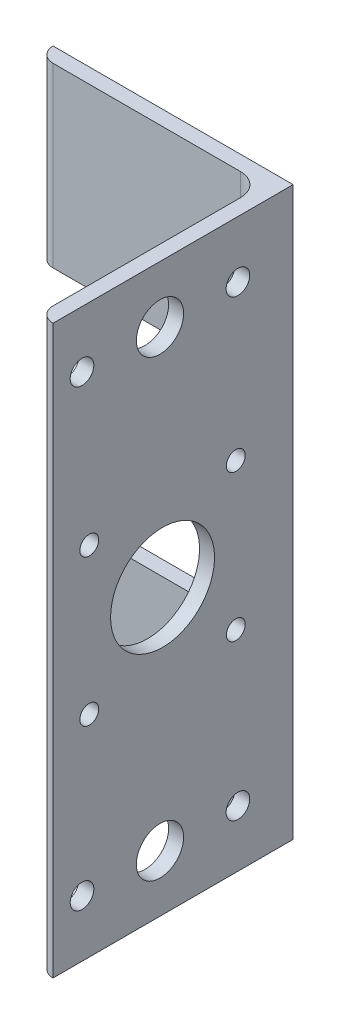
ISO-10303-21;
HEADER;
FILE_DESCRIPTION(('STEP AP214'),'2;1');
FILE_NAME('part.step','',(''),(''),'','','');
FILE_SCHEMA(('AUTOMOTIVE_DESIGN { 1 0 10303 214 1 1 1 1 }'));
ENDSEC;
DATA;
#1=APPLICATION_CONTEXT('core data for automotive mechanical design processes');
#2=APPLICATION_PROTOCOL_DEFINITION('international standard','automotive_design',2000,#1);
#3=PRODUCT_CONTEXT('',#1,'mechanical');
#4=PRODUCT('Part','Part','',(#3));
#5=PRODUCT_RELATED_PRODUCT_CATEGORY('part','',(#4));
#6=PRODUCT_DEFINITION_FORMATION('','',#4);
#7=PRODUCT_DEFINITION_CONTEXT('part definition',#1,'design');
#8=PRODUCT_DEFINITION('design','',#6,#7);
#9=PRODUCT_DEFINITION_SHAPE('','',#8);
#10=(LENGTH_UNIT() NAMED_UNIT(*) SI_UNIT(.MILLI.,.METRE.));
#11=(NAMED_UNIT(*) PLANE_ANGLE_UNIT() SI_UNIT($,.RADIAN.));
#12=(NAMED_UNIT(*) SI_UNIT($,.STERADIAN.) SOLID_ANGLE_UNIT());
#13=UNCERTAINTY_MEASURE_WITH_UNIT(LENGTH_MEASURE(1.E-05),#10,'distance_accuracy_value','');
#14=(GEOMETRIC_REPRESENTATION_CONTEXT(3) GLOBAL_UNCERTAINTY_ASSIGNED_CONTEXT((#13)) GLOBAL_UNIT_ASSIGNED_CONTEXT((#10,
#11,#12)) REPRESENTATION_CONTEXT('',''));
#15=CARTESIAN_POINT('',(0.,0.,0.));
#16=DIRECTION('',(0.,0.,1.));
#17=DIRECTION('',(1.,0.,0.));
#18=AXIS2_PLACEMENT_3D('',#15,#16,#17);
#19=CARTESIAN_POINT('',(-3.17500000000001,120.,47.63008));
#20=DIRECTION('',(1.,0.,0.));
#21=DIRECTION('',(0.,0.,-1.));
#22=AXIS2_PLACEMENT_3D('',#19,#20,#21);
#23=PLANE('',#22);
#24=CARTESIAN_POINT('',(-3.17499999999998,60.,27.63008));
#25=DIRECTION('',(-1.,0.,0.));
#26=DIRECTION('',(0.,0.,1.));
#27=AXIS2_PLACEMENT_3D('',#24,#25,#26);
#28=CIRCLE('',#27,11.);
#29=CARTESIAN_POINT('',(-3.17499999999998,60.,38.63008));
#30=VERTEX_POINT('',#29);
#31=EDGE_CURVE('E553',#30,#30,#28,.T.);
#32=ORIENTED_EDGE('',*,*,#31,.F.);
#33=EDGE_LOOP('',(#32));
#34=FACE_BOUND('',#33,.T.);
#35=CARTESIAN_POINT('',(-3.17500000000004,75.5,12.13008));
#36=DIRECTION('',(-1.,0.,0.));
#37=DIRECTION('',(0.,0.,1.));
#38=AXIS2_PLACEMENT_3D('',#35,#36,#37);
#39=CIRCLE('',#38,2.);
#40=CARTESIAN_POINT('',(-3.17500000000004,75.5,14.13008));
#41=VERTEX_POINT('',#40);
#42=EDGE_CURVE('E555',#41,#41,#39,.T.);
#43=ORIENTED_EDGE('',*,*,#42,.F.);
#44=EDGE_LOOP('',(#43));
#45=FACE_BOUND('',#44,.T.);
#46=CARTESIAN_POINT('',(-3.17500000000001,44.5,12.13008));
#47=DIRECTION('',(-1.,0.,0.));
#48=DIRECTION('',(0.,0.,1.));
#49=AXIS2_PLACEMENT_3D('',#46,#47,#48);
#50=CIRCLE('',#49,2.);
#51=CARTESIAN_POINT('',(-3.17500000000001,44.5,14.13008));
#52=VERTEX_POINT('',#51);
#53=EDGE_CURVE('E619',#52,#52,#50,.T.);
#54=ORIENTED_EDGE('',*,*,#53,.F.);
#55=EDGE_LOOP('',(#54));
#56=FACE_BOUND('',#55,.T.);
#57=CARTESIAN_POINT('',(-3.17499999999998,44.5,43.13008));
#58=DIRECTION('',(-1.,0.,0.));
#59=DIRECTION('',(0.,0.,1.));
#60=AXIS2_PLACEMENT_3D('',#57,#58,#59);
#61=CIRCLE('',#60,2.);
#62=CARTESIAN_POINT('',(-3.17499999999998,44.5,45.13008));
#63=VERTEX_POINT('',#62);
#64=EDGE_CURVE('E612',#63,#63,#61,.T.);
#65=ORIENTED_EDGE('',*,*,#64,.F.);
#66=EDGE_LOOP('',(#65));
#67=FACE_BOUND('',#66,.T.);
#68=CARTESIAN_POINT('',(-3.17500000000001,75.5,43.13008));
#69=DIRECTION('',(-1.,0.,0.));
#70=DIRECTION('',(0.,0.,1.));
#71=AXIS2_PLACEMENT_3D('',#68,#69,#70);
#72=CIRCLE('',#71,2.);
#73=CARTESIAN_POINT('',(-3.17500000000001,75.5,45.13008));
#74=VERTEX_POINT('',#73);
#75=EDGE_CURVE('E561',#74,#74,#72,.T.);
#76=ORIENTED_EDGE('',*,*,#75,.F.);
#77=EDGE_LOOP('',(#76));
#78=FACE_BOUND('',#77,.T.);
#79=CARTESIAN_POINT('',(-3.17500000000001,12.,11.675));
#80=DIRECTION('',(-1.,0.,0.));
#81=DIRECTION('',(0.,0.,1.));
#82=AXIS2_PLACEMENT_3D('',#79,#80,#81);
#83=CIRCLE('',#82,2.5);
#84=CARTESIAN_POINT('',(-3.17500000000001,12.,14.175));
#85=VERTEX_POINT('',#84);
#86=EDGE_CURVE('E572',#85,#85,#83,.T.);
#87=ORIENTED_EDGE('',*,*,#86,.F.);
#88=EDGE_LOOP('',(#87));
#89=FACE_BOUND('',#88,.T.);
#90=CARTESIAN_POINT('',(-3.17499999999998,12.,44.675));
#91=DIRECTION('',(-1.,0.,0.));
#92=DIRECTION('',(0.,0.,1.));
#93=AXIS2_PLACEMENT_3D('',#90,#91,#92);
#94=CIRCLE('',#93,2.5);
#95=CARTESIAN_POINT('',(-3.17499999999998,12.,47.175));
#96=VERTEX_POINT('',#95);
#97=EDGE_CURVE('E575',#96,#96,#94,.T.);
#98=ORIENTED_EDGE('',*,*,#97,.F.);
#99=EDGE_LOOP('',(#98));
#100=FACE_BOUND('',#99,.T.);
#101=CARTESIAN_POINT('',(-3.17499999999998,12.,28.175));
#102=DIRECTION('',(-1.,0.,0.));
#103=DIRECTION('',(0.,0.,1.));
#104=AXIS2_PLACEMENT_3D('',#101,#102,#103);
#105=CIRCLE('',#104,5.);
#106=CARTESIAN_POINT('',(-3.17499999999998,12.,33.175));
#107=VERTEX_POINT('',#106);
#108=EDGE_CURVE('E247',#107,#107,#105,.T.);
#109=ORIENTED_EDGE('',*,*,#108,.F.);
#110=EDGE_LOOP('',(#109));
#111=FACE_BOUND('',#110,.T.);
#112=DIRECTION('',(0.,-1.,0.));
#113=VECTOR('',#112,1.);
#114=CARTESIAN_POINT('',(-3.17500000000001,120.,7.93749999999999));
#115=LINE('',#114,#113);
#116=CARTESIAN_POINT('',(-3.17500000000001,120.,7.93749999999999));
#117=VERTEX_POINT('',#116);
#118=CARTESIAN_POINT('',(-3.17500000000001,82.5,7.93749999999999));
#119=VERTEX_POINT('',#118);
#120=EDGE_CURVE('E228',#117,#119,#115,.T.);
#121=ORIENTED_EDGE('',*,*,#120,.T.);
#122=DIRECTION('',(0.,0.,-1.));
#123=VECTOR('',#122,1.);
#124=CARTESIAN_POINT('',(-3.17500000000001,82.5,10.));
#125=LINE('',#124,#123);
#126=CARTESIAN_POINT('',(-3.17500000000001,82.5,0.));
#127=VERTEX_POINT('',#126);
#128=EDGE_CURVE('E102',#119,#127,#125,.T.);
#129=ORIENTED_EDGE('',*,*,#128,.T.);
#130=DIRECTION('',(0.,-1.,0.));
#131=VECTOR('',#130,1.);
#132=CARTESIAN_POINT('',(-3.17500000000001,82.5,0.));
#133=LINE('',#132,#131);
#134=CARTESIAN_POINT('',(-3.17500000000001,37.5,0.));
#135=VERTEX_POINT('',#134);
#136=EDGE_CURVE('E263',#127,#135,#133,.T.);
#137=ORIENTED_EDGE('',*,*,#136,.T.);
#138=DIRECTION('',(0.,0.,-1.));
#139=VECTOR('',#138,1.);
#140=CARTESIAN_POINT('',(-3.17500000000001,37.5,10.));
#141=LINE('',#140,#139);
#142=CARTESIAN_POINT('',(-3.17500000000001,37.5,7.93749999999999));
#143=VERTEX_POINT('',#142);
#144=EDGE_CURVE('E282',#143,#135,#141,.T.);
#145=ORIENTED_EDGE('',*,*,#144,.F.);
#146=CARTESIAN_POINT('',(-3.17500000000001,0.,7.93749999999999));
#147=VERTEX_POINT('',#146);
#148=EDGE_CURVE('E227',#143,#147,#115,.T.);
#149=ORIENTED_EDGE('',*,*,#148,.T.);
#150=DIRECTION('',(0.,0.,1.));
#151=VECTOR('',#150,1.);
#152=CARTESIAN_POINT('',(-3.17500000000001,0.,47.63008));
#153=LINE('',#152,#151);
#154=CARTESIAN_POINT('',(-3.17499999999998,0.,47.63008));
#155=VERTEX_POINT('',#154);
#156=EDGE_CURVE('E217',#147,#155,#153,.T.);
#157=ORIENTED_EDGE('',*,*,#156,.T.);
#158=DIRECTION('',(0.,-1.,0.));
#159=VECTOR('',#158,1.);
#160=CARTESIAN_POINT('',(-3.17500000000001,120.,47.63008));
#161=LINE('',#160,#159);
#162=CARTESIAN_POINT('',(-3.17500000000001,120.,47.63008));
#163=VERTEX_POINT('',#162);
#164=EDGE_CURVE('E192',#163,#155,#161,.T.);
#165=ORIENTED_EDGE('',*,*,#164,.F.);
#166=DIRECTION('',(0.,0.,1.));
#167=VECTOR('',#166,1.);
#168=CARTESIAN_POINT('',(-3.17500000000001,120.,47.63008));
#169=LINE('',#168,#167);
#170=EDGE_CURVE('E180',#117,#163,#169,.T.);
#171=ORIENTED_EDGE('',*,*,#170,.F.);
#172=EDGE_LOOP('',(#121,#129,#137,#145,#149,#157,#165,#171));
#173=FACE_BOUND('',#172,.T.);
#174=CARTESIAN_POINT('',(-3.17500000000001,108.,11.675));
#175=DIRECTION('',(-1.,0.,0.));
#176=DIRECTION('',(0.,0.,1.));
#177=AXIS2_PLACEMENT_3D('',#174,#175,#176);
#178=CIRCLE('',#177,2.5);
#179=CARTESIAN_POINT('',(-3.17500000000001,108.,14.175));
#180=VERTEX_POINT('',#179);
#181=EDGE_CURVE('E568',#180,#180,#178,.F.);
#182=ORIENTED_EDGE('',*,*,#181,.T.);
#183=EDGE_LOOP('',(#182));
#184=FACE_BOUND('',#183,.T.);
#185=CARTESIAN_POINT('',(-3.17499999999998,108.,28.175));
#186=DIRECTION('',(-1.,0.,0.));
#187=DIRECTION('',(0.,0.,1.));
#188=AXIS2_PLACEMENT_3D('',#185,#186,#187);
#189=CIRCLE('',#188,5.);
#190=CARTESIAN_POINT('',(-3.17499999999998,108.,33.175));
#191=VERTEX_POINT('',#190);
#192=EDGE_CURVE('E571',#191,#191,#189,.F.);
#193=ORIENTED_EDGE('',*,*,#192,.T.);
#194=EDGE_LOOP('',(#193));
#195=FACE_BOUND('',#194,.T.);
#196=CARTESIAN_POINT('',(-3.17499999999998,108.,44.675));
#197=DIRECTION('',(-1.,0.,0.));
#198=DIRECTION('',(0.,0.,1.));
#199=AXIS2_PLACEMENT_3D('',#196,#197,#198);
#200=CIRCLE('',#199,2.5);
#201=CARTESIAN_POINT('',(-3.17499999999998,108.,47.175));
#202=VERTEX_POINT('',#201);
#203=EDGE_CURVE('E578',#202,#202,#200,.F.);
#204=ORIENTED_EDGE('',*,*,#203,.T.);
#205=EDGE_LOOP('',(#204));
#206=FACE_BOUND('',#205,.T.);
#207=ADVANCED_FACE('F85',(#34,#45,#56,#67,#78,#89,#100,#111,#173,#184,#195,#206),#23,.F.);
#208=CARTESIAN_POINT('',(0.,120.,0.));
#209=DIRECTION('',(-1.,0.,0.));
#210=DIRECTION('',(0.,0.,1.));
#211=AXIS2_PLACEMENT_3D('',#208,#209,#210);
#212=PLANE('',#211);
#213=CARTESIAN_POINT('',(0.,60.,27.63008));
#214=DIRECTION('',(-1.,0.,0.));
#215=DIRECTION('',(0.,0.,1.));
#216=AXIS2_PLACEMENT_3D('',#213,#214,#215);
#217=CIRCLE('',#216,11.);
#218=CARTESIAN_POINT('',(0.,60.,38.63008));
#219=VERTEX_POINT('',#218);
#220=EDGE_CURVE('E551',#219,#219,#217,.F.);
#221=ORIENTED_EDGE('',*,*,#220,.F.);
#222=EDGE_LOOP('',(#221));
#223=FACE_BOUND('',#222,.T.);
#224=CARTESIAN_POINT('',(0.,75.5,12.13008));
#225=DIRECTION('',(-1.,0.,0.));
#226=DIRECTION('',(0.,0.,1.));
#227=AXIS2_PLACEMENT_3D('',#224,#225,#226);
#228=CIRCLE('',#227,2.);
#229=CARTESIAN_POINT('',(0.,75.5,14.13008));
#230=VERTEX_POINT('',#229);
#231=EDGE_CURVE('E558',#230,#230,#228,.F.);
#232=ORIENTED_EDGE('',*,*,#231,.F.);
#233=EDGE_LOOP('',(#232));
#234=FACE_BOUND('',#233,.T.);
#235=CARTESIAN_POINT('',(0.,44.5,12.13008));
#236=DIRECTION('',(-1.,0.,0.));
#237=DIRECTION('',(0.,0.,1.));
#238=AXIS2_PLACEMENT_3D('',#235,#236,#237);
#239=CIRCLE('',#238,2.);
#240=CARTESIAN_POINT('',(0.,44.5,14.13008));
#241=VERTEX_POINT('',#240);
#242=EDGE_CURVE('E616',#241,#241,#239,.F.);
#243=ORIENTED_EDGE('',*,*,#242,.F.);
#244=EDGE_LOOP('',(#243));
#245=FACE_BOUND('',#244,.T.);
#246=CARTESIAN_POINT('',(0.,44.5,43.13008));
#247=DIRECTION('',(-1.,0.,0.));
#248=DIRECTION('',(0.,0.,1.));
#249=AXIS2_PLACEMENT_3D('',#246,#247,#248);
#250=CIRCLE('',#249,2.);
#251=CARTESIAN_POINT('',(0.,44.5,45.13008));
#252=VERTEX_POINT('',#251);
#253=EDGE_CURVE('E565',#252,#252,#250,.F.);
#254=ORIENTED_EDGE('',*,*,#253,.F.);
#255=EDGE_LOOP('',(#254));
#256=FACE_BOUND('',#255,.T.);
#257=CARTESIAN_POINT('',(0.,75.5,43.13008));
#258=DIRECTION('',(-1.,0.,0.));
#259=DIRECTION('',(0.,0.,1.));
#260=AXIS2_PLACEMENT_3D('',#257,#258,#259);
#261=CIRCLE('',#260,2.);
#262=CARTESIAN_POINT('',(0.,75.5,45.13008));
#263=VERTEX_POINT('',#262);
#264=EDGE_CURVE('E564',#263,#263,#261,.F.);
#265=ORIENTED_EDGE('',*,*,#264,.F.);
#266=EDGE_LOOP('',(#265));
#267=FACE_BOUND('',#266,.T.);
#268=CARTESIAN_POINT('',(0.,12.,11.675));
#269=DIRECTION('',(-1.,0.,0.));
#270=DIRECTION('',(0.,0.,1.));
#271=AXIS2_PLACEMENT_3D('',#268,#269,#270);
#272=CIRCLE('',#271,2.5);
#273=CARTESIAN_POINT('',(0.,12.,14.175));
#274=VERTEX_POINT('',#273);
#275=EDGE_CURVE('E89',#274,#274,#272,.T.);
#276=ORIENTED_EDGE('',*,*,#275,.T.);
#277=EDGE_LOOP('',(#276));
#278=FACE_BOUND('',#277,.T.);
#279=CARTESIAN_POINT('',(0.,12.,44.675));
#280=DIRECTION('',(-1.,0.,0.));
#281=DIRECTION('',(0.,0.,1.));
#282=AXIS2_PLACEMENT_3D('',#279,#280,#281);
#283=CIRCLE('',#282,2.5);
#284=CARTESIAN_POINT('',(0.,12.,47.175));
#285=VERTEX_POINT('',#284);
#286=EDGE_CURVE('E255',#285,#285,#283,.T.);
#287=ORIENTED_EDGE('',*,*,#286,.T.);
#288=EDGE_LOOP('',(#287));
#289=FACE_BOUND('',#288,.T.);
#290=CARTESIAN_POINT('',(0.,12.,28.175));
#291=DIRECTION('',(-1.,0.,0.));
#292=DIRECTION('',(0.,0.,1.));
#293=AXIS2_PLACEMENT_3D('',#290,#291,#292);
#294=CIRCLE('',#293,5.);
#295=CARTESIAN_POINT('',(0.,12.,33.175));
#296=VERTEX_POINT('',#295);
#297=EDGE_CURVE('E243',#296,#296,#294,.T.);
#298=ORIENTED_EDGE('',*,*,#297,.T.);
#299=EDGE_LOOP('',(#298));
#300=FACE_BOUND('',#299,.T.);
#301=DIRECTION('',(0.,0.,-1.));
#302=VECTOR('',#301,1.);
#303=CARTESIAN_POINT('',(0.,0.,0.));
#304=LINE('',#303,#302);
#305=CARTESIAN_POINT('',(0.,0.,50.8));
#306=VERTEX_POINT('',#305);
#307=CARTESIAN_POINT('',(0.,0.,0.));
#308=VERTEX_POINT('',#307);
#309=EDGE_CURVE('E147',#306,#308,#304,.T.);
#310=ORIENTED_EDGE('',*,*,#309,.T.);
#311=DIRECTION('',(0.,-1.,0.));
#312=VECTOR('',#311,1.);
#313=CARTESIAN_POINT('',(0.,120.,0.));
#314=LINE('',#313,#312);
#315=CARTESIAN_POINT('',(0.,120.,0.));
#316=VERTEX_POINT('',#315);
#317=EDGE_CURVE('E197',#316,#308,#314,.T.);
#318=ORIENTED_EDGE('',*,*,#317,.F.);
#319=DIRECTION('',(0.,0.,-1.));
#320=VECTOR('',#319,1.);
#321=CARTESIAN_POINT('',(0.,120.,0.));
#322=LINE('',#321,#320);
#323=CARTESIAN_POINT('',(0.,120.,50.8));
#324=VERTEX_POINT('',#323);
#325=EDGE_CURVE('E111',#324,#316,#322,.T.);
#326=ORIENTED_EDGE('',*,*,#325,.F.);
#327=DIRECTION('',(0.,-1.,0.));
#328=VECTOR('',#327,1.);
#329=CARTESIAN_POINT('',(0.,120.,50.8));
#330=LINE('',#329,#328);
#331=EDGE_CURVE('E193',#324,#306,#330,.T.);
#332=ORIENTED_EDGE('',*,*,#331,.T.);
#333=EDGE_LOOP('',(#310,#318,#326,#332));
#334=FACE_BOUND('',#333,.T.);
#335=CARTESIAN_POINT('',(0.,108.,11.675));
#336=DIRECTION('',(-1.,0.,0.));
#337=DIRECTION('',(0.,0.,1.));
#338=AXIS2_PLACEMENT_3D('',#335,#336,#337);
#339=CIRCLE('',#338,2.5);
#340=CARTESIAN_POINT('',(0.,108.,14.175));
#341=VERTEX_POINT('',#340);
#342=EDGE_CURVE('E246',#341,#341,#339,.F.);
#343=ORIENTED_EDGE('',*,*,#342,.F.);
#344=EDGE_LOOP('',(#343));
#345=FACE_BOUND('',#344,.T.);
#346=CARTESIAN_POINT('',(0.,108.,28.175));
#347=DIRECTION('',(-1.,0.,0.));
#348=DIRECTION('',(0.,0.,1.));
#349=AXIS2_PLACEMENT_3D('',#346,#347,#348);
#350=CIRCLE('',#349,5.);
#351=CARTESIAN_POINT('',(0.,108.,33.175));
#352=VERTEX_POINT('',#351);
#353=EDGE_CURVE('E250',#352,#352,#350,.F.);
#354=ORIENTED_EDGE('',*,*,#353,.F.);
#355=EDGE_LOOP('',(#354));
#356=FACE_BOUND('',#355,.T.);
#357=CARTESIAN_POINT('',(0.,108.,44.675));
#358=DIRECTION('',(-1.,0.,0.));
#359=DIRECTION('',(0.,0.,1.));
#360=AXIS2_PLACEMENT_3D('',#357,#358,#359);
#361=CIRCLE('',#360,2.5);
#362=CARTESIAN_POINT('',(0.,108.,47.175));
#363=VERTEX_POINT('',#362);
#364=EDGE_CURVE('E253',#363,#363,#361,.F.);
#365=ORIENTED_EDGE('',*,*,#364,.F.);
#366=EDGE_LOOP('',(#365));
#367=FACE_BOUND('',#366,.T.);
#368=ADVANCED_FACE('F322',(#223,#234,#245,#256,#267,#278,#289,#300,#334,#345,#356,#367),#212,.F.);
#369=CARTESIAN_POINT('',(-50.8,120.,0.00507999999999065));
#370=DIRECTION('',(1.,0.,0.));
#371=DIRECTION('',(0.,0.,-1.));
#372=AXIS2_PLACEMENT_3D('',#369,#370,#371);
#373=PLANE('',#372);
#374=DIRECTION('',(0.,-1.,0.));
#375=VECTOR('',#374,1.);
#376=CARTESIAN_POINT('',(-50.8,120.,0.00507999999999065));
#377=LINE('',#376,#375);
#378=CARTESIAN_POINT('',(-50.8,37.5,0.00507999999999065));
#379=VERTEX_POINT('',#378);
#380=CARTESIAN_POINT('',(-50.8,0.,0.00507999999999065));
#381=VERTEX_POINT('',#380);
#382=EDGE_CURVE('E239',#379,#381,#377,.T.);
#383=ORIENTED_EDGE('',*,*,#382,.F.);
#384=DIRECTION('',(0.,0.,-1.));
#385=VECTOR('',#384,1.);
#386=CARTESIAN_POINT('',(-50.8,37.5,10.));
#387=LINE('',#386,#385);
#388=CARTESIAN_POINT('',(-50.8,37.5,0.));
#389=VERTEX_POINT('',#388);
#390=EDGE_CURVE('E278',#379,#389,#387,.T.);
#391=ORIENTED_EDGE('',*,*,#390,.T.);
#392=DIRECTION('',(0.,-1.,0.));
#393=VECTOR('',#392,1.);
#394=CARTESIAN_POINT('',(-50.8,120.,0.));
#395=LINE('',#394,#393);
#396=CARTESIAN_POINT('',(-50.8,0.,0.));
#397=VERTEX_POINT('',#396);
#398=EDGE_CURVE('E94',#389,#397,#395,.T.);
#399=ORIENTED_EDGE('',*,*,#398,.T.);
#400=DIRECTION('',(0.,0.,1.));
#401=VECTOR('',#400,1.);
#402=CARTESIAN_POINT('',(-50.8,0.,0.00507999999999065));
#403=LINE('',#402,#401);
#404=EDGE_CURVE('E204',#397,#381,#403,.T.);
#405=ORIENTED_EDGE('',*,*,#404,.T.);
#406=EDGE_LOOP('',(#383,#391,#399,#405));
#407=FACE_BOUND('',#406,.T.);
#408=ADVANCED_FACE('F375',(#407),#373,.F.);
#409=CARTESIAN_POINT('',(-47.63008,120.,0.00507999999999065));
#410=DIRECTION('',(0.,-1.,0.));
#411=DIRECTION('',(0.,0.,-1.));
#412=AXIS2_PLACEMENT_3D('',#409,#410,#411);
#413=CYLINDRICAL_SURFACE('',#412,3.16992);
#414=DIRECTION('',(0.,-1.,0.));
#415=VECTOR('',#414,1.);
#416=CARTESIAN_POINT('',(-47.63008,120.,3.17500000000001));
#417=LINE('',#416,#415);
#418=CARTESIAN_POINT('',(-47.63008,37.5,3.17500000000001));
#419=VERTEX_POINT('',#418);
#420=CARTESIAN_POINT('',(-47.63008,0.,3.17500000000001));
#421=VERTEX_POINT('',#420);
#422=EDGE_CURVE('E235',#419,#421,#417,.T.);
#423=ORIENTED_EDGE('',*,*,#422,.F.);
#424=CARTESIAN_POINT('',(-47.63008,37.5,0.00507999999999065));
#425=DIRECTION('',(0.,-1.,0.));
#426=DIRECTION('',(0.,0.,-1.));
#427=AXIS2_PLACEMENT_3D('',#424,#425,#426);
#428=CIRCLE('',#427,3.16992);
#429=EDGE_CURVE('E205',#419,#379,#428,.T.);
#430=ORIENTED_EDGE('',*,*,#429,.T.);
#431=ORIENTED_EDGE('',*,*,#382,.T.);
#432=CARTESIAN_POINT('',(-47.63008,0.,0.00507999999999065));
#433=DIRECTION('',(0.,1.,0.));
#434=DIRECTION('',(0.,0.,1.));
#435=AXIS2_PLACEMENT_3D('',#432,#433,#434);
#436=CIRCLE('',#435,3.16992);
#437=EDGE_CURVE('E208',#381,#421,#436,.T.);
#438=ORIENTED_EDGE('',*,*,#437,.T.);
#439=EDGE_LOOP('',(#423,#430,#431,#438));
#440=FACE_BOUND('',#439,.T.);
#441=ADVANCED_FACE('F363',(#440),#413,.T.);
#442=CARTESIAN_POINT('',(-7.93750000000001,120.,3.17499999999998));
#443=DIRECTION('',(0.,0.,-1.));
#444=DIRECTION('',(-1.,0.,0.));
#445=AXIS2_PLACEMENT_3D('',#442,#443,#444);
#446=PLANE('',#445);
#447=DIRECTION('',(0.,-1.,0.));
#448=VECTOR('',#447,1.);
#449=CARTESIAN_POINT('',(-7.93750000000001,120.,3.17499999999998));
#450=LINE('',#449,#448);
#451=CARTESIAN_POINT('',(-7.93750000000001,37.5,3.17499999999998));
#452=VERTEX_POINT('',#451);
#453=CARTESIAN_POINT('',(-7.93750000000001,0.,3.17499999999998));
#454=VERTEX_POINT('',#453);
#455=EDGE_CURVE('E231',#452,#454,#450,.T.);
#456=ORIENTED_EDGE('',*,*,#455,.F.);
#457=DIRECTION('',(-1.,0.,0.));
#458=VECTOR('',#457,1.);
#459=CARTESIAN_POINT('',(-7.93750000000001,37.5,3.17499999999998));
#460=LINE('',#459,#458);
#461=EDGE_CURVE('E297',#452,#419,#460,.T.);
#462=ORIENTED_EDGE('',*,*,#461,.T.);
#463=ORIENTED_EDGE('',*,*,#422,.T.);
#464=DIRECTION('',(1.,0.,0.));
#465=VECTOR('',#464,1.);
#466=CARTESIAN_POINT('',(-7.93750000000001,0.,3.17499999999998));
#467=LINE('',#466,#465);
#468=EDGE_CURVE('E211',#421,#454,#467,.T.);
#469=ORIENTED_EDGE('',*,*,#468,.T.);
#470=EDGE_LOOP('',(#456,#462,#463,#469));
#471=FACE_BOUND('',#470,.T.);
#472=ADVANCED_FACE('F362',(#471),#446,.F.);
#473=CARTESIAN_POINT('',(-7.93750000000001,120.,7.93749999999999));
#474=DIRECTION('',(0.,-1.,0.));
#475=DIRECTION('',(0.,0.,-1.));
#476=AXIS2_PLACEMENT_3D('',#473,#474,#475);
#477=CYLINDRICAL_SURFACE('',#476,4.7625);
#478=ORIENTED_EDGE('',*,*,#148,.F.);
#479=CARTESIAN_POINT('',(-7.93750000000001,37.5,7.93749999999999));
#480=DIRECTION('',(0.,-1.,0.));
#481=DIRECTION('',(0.,0.,-1.));
#482=AXIS2_PLACEMENT_3D('',#479,#480,#481);
#483=CIRCLE('',#482,4.7625);
#484=EDGE_CURVE('E294',#143,#452,#483,.F.);
#485=ORIENTED_EDGE('',*,*,#484,.T.);
#486=ORIENTED_EDGE('',*,*,#455,.T.);
#487=CARTESIAN_POINT('',(-7.93750000000001,0.,7.93749999999999));
#488=DIRECTION('',(0.,-1.,0.));
#489=DIRECTION('',(0.,0.,-1.));
#490=AXIS2_PLACEMENT_3D('',#487,#488,#489);
#491=CIRCLE('',#490,4.7625);
#492=EDGE_CURVE('E214',#454,#147,#491,.T.);
#493=ORIENTED_EDGE('',*,*,#492,.T.);
#494=EDGE_LOOP('',(#478,#485,#486,#493));
#495=FACE_BOUND('',#494,.T.);
#496=ADVANCED_FACE('F369',(#495),#477,.F.);
#497=CARTESIAN_POINT('',(-50.8,120.,0.));
#498=DIRECTION('',(0.,0.,1.));
#499=DIRECTION('',(1.,0.,0.));
#500=AXIS2_PLACEMENT_3D('',#497,#498,#499);
#501=PLANE('',#500);
#502=ORIENTED_EDGE('',*,*,#398,.F.);
#503=DIRECTION('',(-1.,0.,0.));
#504=VECTOR('',#503,1.);
#505=CARTESIAN_POINT('',(-3.17500000000001,37.5,0.));
#506=LINE('',#505,#504);
#507=EDGE_CURVE('E270',#135,#389,#506,.T.);
#508=ORIENTED_EDGE('',*,*,#507,.F.);
#509=ORIENTED_EDGE('',*,*,#136,.F.);
#510=DIRECTION('',(1.,0.,0.));
#511=VECTOR('',#510,1.);
#512=CARTESIAN_POINT('',(-3.17500000000001,82.5,0.));
#513=LINE('',#512,#511);
#514=CARTESIAN_POINT('',(-50.8,82.5,0.));
#515=VERTEX_POINT('',#514);
#516=EDGE_CURVE('E260',#515,#127,#513,.T.);
#517=ORIENTED_EDGE('',*,*,#516,.F.);
#518=CARTESIAN_POINT('',(-50.8,120.,0.));
#519=VERTEX_POINT('',#518);
#520=EDGE_CURVE('E15',#519,#515,#395,.T.);
#521=ORIENTED_EDGE('',*,*,#520,.F.);
#522=DIRECTION('',(-1.,0.,0.));
#523=VECTOR('',#522,1.);
#524=CARTESIAN_POINT('',(-50.8,120.,0.));
#525=LINE('',#524,#523);
#526=EDGE_CURVE('E223',#316,#519,#525,.T.);
#527=ORIENTED_EDGE('',*,*,#526,.F.);
#528=ORIENTED_EDGE('',*,*,#317,.T.);
#529=DIRECTION('',(-1.,0.,0.));
#530=VECTOR('',#529,1.);
#531=CARTESIAN_POINT('',(-50.8,0.,0.));
#532=LINE('',#531,#530);
#533=EDGE_CURVE('E201',#308,#397,#532,.T.);
#534=ORIENTED_EDGE('',*,*,#533,.T.);
#535=EDGE_LOOP('',(#502,#508,#509,#517,#521,#527,#528,#534));
#536=FACE_BOUND('',#535,.T.);
#537=ADVANCED_FACE('F87',(#536),#501,.F.);
#538=ORIENTED_EDGE('',*,*,#520,.T.);
#539=DIRECTION('',(0.,0.,-1.));
#540=VECTOR('',#539,1.);
#541=CARTESIAN_POINT('',(-50.8,82.5,10.));
#542=LINE('',#541,#540);
#543=CARTESIAN_POINT('',(-50.8,82.5,0.00507999999999065));
#544=VERTEX_POINT('',#543);
#545=EDGE_CURVE('E277',#544,#515,#542,.T.);
#546=ORIENTED_EDGE('',*,*,#545,.F.);
#547=CARTESIAN_POINT('',(-50.8,120.,0.00507999999999065));
#548=VERTEX_POINT('',#547);
#549=EDGE_CURVE('E240',#548,#544,#377,.T.);
#550=ORIENTED_EDGE('',*,*,#549,.F.);
#551=DIRECTION('',(0.,0.,1.));
#552=VECTOR('',#551,1.);
#553=CARTESIAN_POINT('',(-50.8,120.,0.00507999999999065));
#554=LINE('',#553,#552);
#555=EDGE_CURVE('E155',#519,#548,#554,.T.);
#556=ORIENTED_EDGE('',*,*,#555,.F.);
#557=EDGE_LOOP('',(#538,#546,#550,#556));
#558=FACE_BOUND('',#557,.T.);
#559=ADVANCED_FACE('F331',(#558),#373,.F.);
#560=ORIENTED_EDGE('',*,*,#549,.T.);
#561=CARTESIAN_POINT('',(-47.63008,82.5,0.00507999999999065));
#562=DIRECTION('',(0.,1.,0.));
#563=DIRECTION('',(0.,0.,1.));
#564=AXIS2_PLACEMENT_3D('',#561,#562,#563);
#565=CIRCLE('',#564,3.16992);
#566=CARTESIAN_POINT('',(-47.63008,82.5,3.17500000000001));
#567=VERTEX_POINT('',#566);
#568=EDGE_CURVE('E291',#544,#567,#565,.T.);
#569=ORIENTED_EDGE('',*,*,#568,.T.);
#570=CARTESIAN_POINT('',(-47.63008,120.,3.17500000000001));
#571=VERTEX_POINT('',#570);
#572=EDGE_CURVE('E236',#571,#567,#417,.T.);
#573=ORIENTED_EDGE('',*,*,#572,.F.);
#574=CARTESIAN_POINT('',(-47.63008,120.,0.00507999999999065));
#575=DIRECTION('',(0.,1.,0.));
#576=DIRECTION('',(0.,0.,1.));
#577=AXIS2_PLACEMENT_3D('',#574,#575,#576);
#578=CIRCLE('',#577,3.16992);
#579=EDGE_CURVE('E304',#548,#571,#578,.T.);
#580=ORIENTED_EDGE('',*,*,#579,.F.);
#581=EDGE_LOOP('',(#560,#569,#573,#580));
#582=FACE_BOUND('',#581,.T.);
#583=ADVANCED_FACE('F334',(#582),#413,.T.);
#584=ORIENTED_EDGE('',*,*,#572,.T.);
#585=DIRECTION('',(1.,0.,0.));
#586=VECTOR('',#585,1.);
#587=CARTESIAN_POINT('',(-7.93750000000001,82.5,3.17499999999998));
#588=LINE('',#587,#586);
#589=CARTESIAN_POINT('',(-7.93750000000001,82.5,3.17499999999998));
#590=VERTEX_POINT('',#589);
#591=EDGE_CURVE('E288',#567,#590,#588,.T.);
#592=ORIENTED_EDGE('',*,*,#591,.T.);
#593=CARTESIAN_POINT('',(-7.93750000000001,120.,3.17499999999998));
#594=VERTEX_POINT('',#593);
#595=EDGE_CURVE('E232',#594,#590,#450,.T.);
#596=ORIENTED_EDGE('',*,*,#595,.F.);
#597=DIRECTION('',(1.,0.,0.));
#598=VECTOR('',#597,1.);
#599=CARTESIAN_POINT('',(-7.93750000000001,120.,3.17499999999998));
#600=LINE('',#599,#598);
#601=EDGE_CURVE('E306',#571,#594,#600,.T.);
#602=ORIENTED_EDGE('',*,*,#601,.F.);
#603=EDGE_LOOP('',(#584,#592,#596,#602));
#604=FACE_BOUND('',#603,.T.);
#605=ADVANCED_FACE('F338',(#604),#446,.F.);
#606=ORIENTED_EDGE('',*,*,#595,.T.);
#607=CARTESIAN_POINT('',(-7.93750000000001,82.5,7.93749999999999));
#608=DIRECTION('',(0.,1.,0.));
#609=DIRECTION('',(0.,0.,1.));
#610=AXIS2_PLACEMENT_3D('',#607,#608,#609);
#611=CIRCLE('',#610,4.7625);
#612=EDGE_CURVE('E281',#590,#119,#611,.F.);
#613=ORIENTED_EDGE('',*,*,#612,.T.);
#614=ORIENTED_EDGE('',*,*,#120,.F.);
#615=CARTESIAN_POINT('',(-7.93750000000001,120.,7.93749999999999));
#616=DIRECTION('',(0.,-1.,0.));
#617=DIRECTION('',(0.,0.,-1.));
#618=AXIS2_PLACEMENT_3D('',#615,#616,#617);
#619=CIRCLE('',#618,4.7625);
#620=EDGE_CURVE('E308',#594,#117,#619,.T.);
#621=ORIENTED_EDGE('',*,*,#620,.F.);
#622=EDGE_LOOP('',(#606,#613,#614,#621));
#623=FACE_BOUND('',#622,.T.);
#624=ADVANCED_FACE('F314',(#623),#477,.F.);
#625=CARTESIAN_POINT('',(-0.00507999999999065,120.,47.63008));
#626=DIRECTION('',(0.,-1.,0.));
#627=DIRECTION('',(0.,0.,-1.));
#628=AXIS2_PLACEMENT_3D('',#625,#626,#627);
#629=CYLINDRICAL_SURFACE('',#628,3.16992);
#630=CARTESIAN_POINT('',(-0.00507999999999065,0.,47.63008));
#631=DIRECTION('',(0.,1.,0.));
#632=DIRECTION('',(0.,0.,-1.));
#633=AXIS2_PLACEMENT_3D('',#630,#631,#632);
#634=CIRCLE('',#633,3.16992);
#635=CARTESIAN_POINT('',(-0.00507999999999065,0.,50.8));
#636=VERTEX_POINT('',#635);
#637=EDGE_CURVE('E189',#155,#636,#634,.T.);
#638=ORIENTED_EDGE('',*,*,#637,.T.);
#639=DIRECTION('',(0.,-1.,0.));
#640=VECTOR('',#639,1.);
#641=CARTESIAN_POINT('',(-0.00507999999999065,120.,50.8));
#642=LINE('',#641,#640);
#643=CARTESIAN_POINT('',(-0.00507999999999065,120.,50.8));
#644=VERTEX_POINT('',#643);
#645=EDGE_CURVE('E186',#644,#636,#642,.T.);
#646=ORIENTED_EDGE('',*,*,#645,.F.);
#647=CARTESIAN_POINT('',(-0.00507999999999065,120.,47.63008));
#648=DIRECTION('',(0.,1.,0.));
#649=DIRECTION('',(0.,0.,-1.));
#650=AXIS2_PLACEMENT_3D('',#647,#648,#649);
#651=CIRCLE('',#650,3.16992);
#652=EDGE_CURVE('E173',#163,#644,#651,.T.);
#653=ORIENTED_EDGE('',*,*,#652,.F.);
#654=ORIENTED_EDGE('',*,*,#164,.T.);
#655=EDGE_LOOP('',(#638,#646,#653,#654));
#656=FACE_BOUND('',#655,.T.);
#657=ADVANCED_FACE('F187',(#656),#629,.T.);
#658=CARTESIAN_POINT('',(0.,120.,50.8));
#659=DIRECTION('',(0.,0.,-1.));
#660=DIRECTION('',(-1.,0.,0.));
#661=AXIS2_PLACEMENT_3D('',#658,#659,#660);
#662=PLANE('',#661);
#663=DIRECTION('',(1.,0.,0.));
#664=VECTOR('',#663,1.);
#665=CARTESIAN_POINT('',(0.,0.,50.8));
#666=LINE('',#665,#664);
#667=EDGE_CURVE('E220',#636,#306,#666,.T.);
#668=ORIENTED_EDGE('',*,*,#667,.T.);
#669=ORIENTED_EDGE('',*,*,#331,.F.);
#670=DIRECTION('',(1.,0.,0.));
#671=VECTOR('',#670,1.);
#672=CARTESIAN_POINT('',(0.,120.,50.8));
#673=LINE('',#672,#671);
#674=EDGE_CURVE('E177',#644,#324,#673,.T.);
#675=ORIENTED_EDGE('',*,*,#674,.F.);
#676=ORIENTED_EDGE('',*,*,#645,.T.);
#677=EDGE_LOOP('',(#668,#669,#675,#676));
#678=FACE_BOUND('',#677,.T.);
#679=ADVANCED_FACE('F195',(#678),#662,.F.);
#680=CARTESIAN_POINT('',(-0.00507999999999065,120.,47.63008));
#681=DIRECTION('',(0.,-1.,0.));
#682=DIRECTION('',(0.,0.,-1.));
#683=AXIS2_PLACEMENT_3D('',#680,#681,#682);
#684=PLANE('',#683);
#685=ORIENTED_EDGE('',*,*,#526,.T.);
#686=ORIENTED_EDGE('',*,*,#555,.T.);
#687=ORIENTED_EDGE('',*,*,#579,.T.);
#688=ORIENTED_EDGE('',*,*,#601,.T.);
#689=ORIENTED_EDGE('',*,*,#620,.T.);
#690=ORIENTED_EDGE('',*,*,#170,.T.);
#691=ORIENTED_EDGE('',*,*,#652,.T.);
#692=ORIENTED_EDGE('',*,*,#674,.T.);
#693=ORIENTED_EDGE('',*,*,#325,.T.);
#694=EDGE_LOOP('',(#685,#686,#687,#688,#689,#690,#691,#692,#693));
#695=FACE_BOUND('',#694,.T.);
#696=ADVANCED_FACE('F175',(#695),#684,.F.);
#697=CARTESIAN_POINT('',(-0.00507999999999065,0.,47.63008));
#698=DIRECTION('',(0.,-1.,0.));
#699=DIRECTION('',(0.,0.,-1.));
#700=AXIS2_PLACEMENT_3D('',#697,#698,#699);
#701=PLANE('',#700);
#702=ORIENTED_EDGE('',*,*,#533,.F.);
#703=ORIENTED_EDGE('',*,*,#309,.F.);
#704=ORIENTED_EDGE('',*,*,#667,.F.);
#705=ORIENTED_EDGE('',*,*,#637,.F.);
#706=ORIENTED_EDGE('',*,*,#156,.F.);
#707=ORIENTED_EDGE('',*,*,#492,.F.);
#708=ORIENTED_EDGE('',*,*,#468,.F.);
#709=ORIENTED_EDGE('',*,*,#437,.F.);
#710=ORIENTED_EDGE('',*,*,#404,.F.);
#711=EDGE_LOOP('',(#702,#703,#704,#705,#706,#707,#708,#709,#710));
#712=FACE_BOUND('',#711,.T.);
#713=ADVANCED_FACE('F320',(#712),#701,.T.);
#714=CARTESIAN_POINT('',(-3.17500000000001,37.5,10.));
#715=DIRECTION('',(0.,-1.,0.));
#716=DIRECTION('',(0.,0.,-1.));
#717=AXIS2_PLACEMENT_3D('',#714,#715,#716);
#718=PLANE('',#717);
#719=ORIENTED_EDGE('',*,*,#461,.F.);
#720=ORIENTED_EDGE('',*,*,#484,.F.);
#721=ORIENTED_EDGE('',*,*,#144,.T.);
#722=ORIENTED_EDGE('',*,*,#507,.T.);
#723=ORIENTED_EDGE('',*,*,#390,.F.);
#724=ORIENTED_EDGE('',*,*,#429,.F.);
#725=EDGE_LOOP('',(#719,#720,#721,#722,#723,#724));
#726=FACE_BOUND('',#725,.T.);
#727=ADVANCED_FACE('F356',(#726),#718,.F.);
#728=CARTESIAN_POINT('',(-3.17500000000001,82.5,10.));
#729=DIRECTION('',(0.,1.,0.));
#730=DIRECTION('',(0.,0.,1.));
#731=AXIS2_PLACEMENT_3D('',#728,#729,#730);
#732=PLANE('',#731);
#733=ORIENTED_EDGE('',*,*,#545,.T.);
#734=ORIENTED_EDGE('',*,*,#516,.T.);
#735=ORIENTED_EDGE('',*,*,#128,.F.);
#736=ORIENTED_EDGE('',*,*,#612,.F.);
#737=ORIENTED_EDGE('',*,*,#591,.F.);
#738=ORIENTED_EDGE('',*,*,#568,.F.);
#739=EDGE_LOOP('',(#733,#734,#735,#736,#737,#738));
#740=FACE_BOUND('',#739,.T.);
#741=ADVANCED_FACE('F448',(#740),#732,.F.);
#742=CARTESIAN_POINT('',(6.825,12.,28.175));
#743=DIRECTION('',(-1.,0.,0.));
#744=DIRECTION('',(0.,0.,1.));
#745=AXIS2_PLACEMENT_3D('',#742,#743,#744);
#746=CYLINDRICAL_SURFACE('',#745,5.);
#747=ORIENTED_EDGE('',*,*,#108,.T.);
#748=EDGE_LOOP('',(#747));
#749=FACE_BOUND('',#748,.T.);
#750=ORIENTED_EDGE('',*,*,#297,.F.);
#751=EDGE_LOOP('',(#750));
#752=FACE_BOUND('',#751,.T.);
#753=ADVANCED_FACE('F456',(#749,#752),#746,.F.);
#754=CARTESIAN_POINT('',(6.825,108.,11.675));
#755=DIRECTION('',(-1.,0.,0.));
#756=DIRECTION('',(0.,0.,1.));
#757=AXIS2_PLACEMENT_3D('',#754,#755,#756);
#758=CYLINDRICAL_SURFACE('',#757,2.5);
#759=ORIENTED_EDGE('',*,*,#181,.F.);
#760=EDGE_LOOP('',(#759));
#761=FACE_BOUND('',#760,.T.);
#762=ORIENTED_EDGE('',*,*,#342,.T.);
#763=EDGE_LOOP('',(#762));
#764=FACE_BOUND('',#763,.T.);
#765=ADVANCED_FACE('F464',(#761,#764),#758,.F.);
#766=CARTESIAN_POINT('',(6.825,108.,28.175));
#767=DIRECTION('',(-1.,0.,0.));
#768=DIRECTION('',(0.,0.,1.));
#769=AXIS2_PLACEMENT_3D('',#766,#767,#768);
#770=CYLINDRICAL_SURFACE('',#769,5.);
#771=ORIENTED_EDGE('',*,*,#192,.F.);
#772=EDGE_LOOP('',(#771));
#773=FACE_BOUND('',#772,.T.);
#774=ORIENTED_EDGE('',*,*,#353,.T.);
#775=EDGE_LOOP('',(#774));
#776=FACE_BOUND('',#775,.T.);
#777=ADVANCED_FACE('F473',(#773,#776),#770,.F.);
#778=CARTESIAN_POINT('',(6.82500000000003,108.,44.675));
#779=DIRECTION('',(-1.,0.,0.));
#780=DIRECTION('',(0.,0.,1.));
#781=AXIS2_PLACEMENT_3D('',#778,#779,#780);
#782=CYLINDRICAL_SURFACE('',#781,2.5);
#783=ORIENTED_EDGE('',*,*,#203,.F.);
#784=EDGE_LOOP('',(#783));
#785=FACE_BOUND('',#784,.T.);
#786=ORIENTED_EDGE('',*,*,#364,.T.);
#787=EDGE_LOOP('',(#786));
#788=FACE_BOUND('',#787,.T.);
#789=ADVANCED_FACE('F481',(#785,#788),#782,.F.);
#790=CARTESIAN_POINT('',(6.82500000000003,12.,44.675));
#791=DIRECTION('',(-1.,0.,0.));
#792=DIRECTION('',(0.,0.,1.));
#793=AXIS2_PLACEMENT_3D('',#790,#791,#792);
#794=CYLINDRICAL_SURFACE('',#793,2.5);
#795=ORIENTED_EDGE('',*,*,#97,.T.);
#796=EDGE_LOOP('',(#795));
#797=FACE_BOUND('',#796,.T.);
#798=ORIENTED_EDGE('',*,*,#286,.F.);
#799=EDGE_LOOP('',(#798));
#800=FACE_BOUND('',#799,.T.);
#801=ADVANCED_FACE('F489',(#797,#800),#794,.F.);
#802=CARTESIAN_POINT('',(6.825,12.,11.675));
#803=DIRECTION('',(-1.,0.,0.));
#804=DIRECTION('',(0.,0.,1.));
#805=AXIS2_PLACEMENT_3D('',#802,#803,#804);
#806=CYLINDRICAL_SURFACE('',#805,2.5);
#807=ORIENTED_EDGE('',*,*,#86,.T.);
#808=EDGE_LOOP('',(#807));
#809=FACE_BOUND('',#808,.T.);
#810=ORIENTED_EDGE('',*,*,#275,.F.);
#811=EDGE_LOOP('',(#810));
#812=FACE_BOUND('',#811,.T.);
#813=ADVANCED_FACE('F497',(#809,#812),#806,.F.);
#814=CARTESIAN_POINT('',(31.1126983722081,75.5,43.13008));
#815=DIRECTION('',(-1.,0.,0.));
#816=DIRECTION('',(0.,0.,1.));
#817=AXIS2_PLACEMENT_3D('',#814,#815,#816);
#818=CYLINDRICAL_SURFACE('',#817,2.);
#819=ORIENTED_EDGE('',*,*,#264,.T.);
#820=EDGE_LOOP('',(#819));
#821=FACE_BOUND('',#820,.T.);
#822=ORIENTED_EDGE('',*,*,#75,.T.);
#823=EDGE_LOOP('',(#822));
#824=FACE_BOUND('',#823,.T.);
#825=ADVANCED_FACE('F505',(#821,#824),#818,.F.);
#826=CARTESIAN_POINT('',(31.1126983722081,44.5,43.13008));
#827=DIRECTION('',(-1.,0.,0.));
#828=DIRECTION('',(0.,0.,1.));
#829=AXIS2_PLACEMENT_3D('',#826,#827,#828);
#830=CYLINDRICAL_SURFACE('',#829,2.);
#831=ORIENTED_EDGE('',*,*,#253,.T.);
#832=EDGE_LOOP('',(#831));
#833=FACE_BOUND('',#832,.T.);
#834=ORIENTED_EDGE('',*,*,#64,.T.);
#835=EDGE_LOOP('',(#834));
#836=FACE_BOUND('',#835,.T.);
#837=ADVANCED_FACE('F513',(#833,#836),#830,.F.);
#838=CARTESIAN_POINT('',(31.1126983722081,44.5,12.13008));
#839=DIRECTION('',(-1.,0.,0.));
#840=DIRECTION('',(0.,0.,1.));
#841=AXIS2_PLACEMENT_3D('',#838,#839,#840);
#842=CYLINDRICAL_SURFACE('',#841,2.);
#843=ORIENTED_EDGE('',*,*,#242,.T.);
#844=EDGE_LOOP('',(#843));
#845=FACE_BOUND('',#844,.T.);
#846=ORIENTED_EDGE('',*,*,#53,.T.);
#847=EDGE_LOOP('',(#846));
#848=FACE_BOUND('',#847,.T.);
#849=ADVANCED_FACE('F521',(#845,#848),#842,.F.);
#850=CARTESIAN_POINT('',(31.112698372208,75.5,12.13008));
#851=DIRECTION('',(-1.,0.,0.));
#852=DIRECTION('',(0.,0.,1.));
#853=AXIS2_PLACEMENT_3D('',#850,#851,#852);
#854=CYLINDRICAL_SURFACE('',#853,2.);
#855=ORIENTED_EDGE('',*,*,#231,.T.);
#856=EDGE_LOOP('',(#855));
#857=FACE_BOUND('',#856,.T.);
#858=ORIENTED_EDGE('',*,*,#42,.T.);
#859=EDGE_LOOP('',(#858));
#860=FACE_BOUND('',#859,.T.);
#861=ADVANCED_FACE('F529',(#857,#860),#854,.F.);
#862=CARTESIAN_POINT('',(31.1126983722081,60.,27.63008));
#863=DIRECTION('',(-1.,0.,0.));
#864=DIRECTION('',(0.,0.,1.));
#865=AXIS2_PLACEMENT_3D('',#862,#863,#864);
#866=CYLINDRICAL_SURFACE('',#865,11.);
#867=ORIENTED_EDGE('',*,*,#220,.T.);
#868=EDGE_LOOP('',(#867));
#869=FACE_BOUND('',#868,.T.);
#870=ORIENTED_EDGE('',*,*,#31,.T.);
#871=EDGE_LOOP('',(#870));
#872=FACE_BOUND('',#871,.T.);
#873=ADVANCED_FACE('F537',(#869,#872),#866,.F.);
#874=CLOSED_SHELL('',(#207,#368,#408,#441,#472,#496,#537,#559,#583,#605,#624,#657,#679,#696,
#713,#727,#741,#753,#765,#777,#789,#801,#813,#825,#837,#849,#861,#873));
#875=MANIFOLD_SOLID_BREP('B2',#874);
#876=ADVANCED_BREP_SHAPE_REPRESENTATION('',(#18,#875),#14);
#877=SHAPE_DEFINITION_REPRESENTATION(#9,#876);
ENDSEC;
END-ISO-10303-21;
